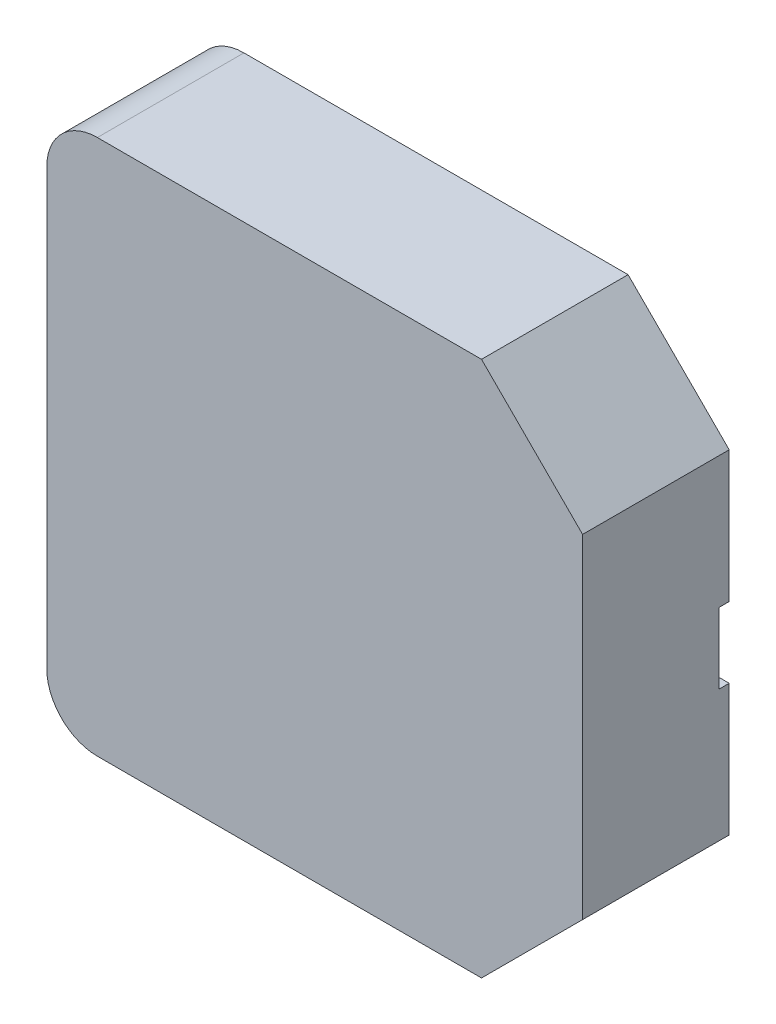
ISO-10303-21;
HEADER;
FILE_DESCRIPTION(('STEP AP214'),'2;1');
FILE_NAME('part.step','',(''),(''),'','','');
FILE_SCHEMA(('AUTOMOTIVE_DESIGN { 1 0 10303 214 1 1 1 1 }'));
ENDSEC;
DATA;
#1=APPLICATION_CONTEXT('core data for automotive mechanical design processes');
#2=APPLICATION_PROTOCOL_DEFINITION('international standard','automotive_design',2000,#1);
#3=PRODUCT_CONTEXT('',#1,'mechanical');
#4=PRODUCT('Part','Part','',(#3));
#5=PRODUCT_RELATED_PRODUCT_CATEGORY('part','',(#4));
#6=PRODUCT_DEFINITION_FORMATION('','',#4);
#7=PRODUCT_DEFINITION_CONTEXT('part definition',#1,'design');
#8=PRODUCT_DEFINITION('design','',#6,#7);
#9=PRODUCT_DEFINITION_SHAPE('','',#8);
#10=(LENGTH_UNIT() NAMED_UNIT(*) SI_UNIT(.MILLI.,.METRE.));
#11=(NAMED_UNIT(*) PLANE_ANGLE_UNIT() SI_UNIT($,.RADIAN.));
#12=(NAMED_UNIT(*) SI_UNIT($,.STERADIAN.) SOLID_ANGLE_UNIT());
#13=UNCERTAINTY_MEASURE_WITH_UNIT(LENGTH_MEASURE(1.E-05),#10,'distance_accuracy_value','');
#14=(GEOMETRIC_REPRESENTATION_CONTEXT(3) GLOBAL_UNCERTAINTY_ASSIGNED_CONTEXT((#13)) GLOBAL_UNIT_ASSIGNED_CONTEXT((#10,
#11,#12)) REPRESENTATION_CONTEXT('',''));
#15=CARTESIAN_POINT('',(0.,0.,0.));
#16=DIRECTION('',(0.,0.,1.));
#17=DIRECTION('',(1.,0.,0.));
#18=AXIS2_PLACEMENT_3D('',#15,#16,#17);
#19=CARTESIAN_POINT('',(1.05723560904739,2.65,0.1));
#20=DIRECTION('',(0.,0.,1.));
#21=DIRECTION('',(1.,0.,0.));
#22=AXIS2_PLACEMENT_3D('',#19,#20,#21);
#23=PLANE('',#22);
#24=CARTESIAN_POINT('',(1.9,2.65,0.1));
#25=DIRECTION('',(0.,0.,-1.));
#26=DIRECTION('',(-1.,0.,0.));
#27=AXIS2_PLACEMENT_3D('',#24,#25,#26);
#28=CIRCLE('',#27,0.35);
#29=CARTESIAN_POINT('',(1.9,3.,0.1));
#30=VERTEX_POINT('',#29);
#31=CARTESIAN_POINT('',(1.9,2.3,0.1));
#32=VERTEX_POINT('',#31);
#33=EDGE_CURVE('E20',#30,#32,#28,.T.);
#34=ORIENTED_EDGE('',*,*,#33,.T.);
#35=DIRECTION('',(1.,0.,0.));
#36=VECTOR('',#35,1.);
#37=CARTESIAN_POINT('',(1.9,2.3,0.1));
#38=LINE('',#37,#36);
#39=CARTESIAN_POINT('',(0.,2.3,0.1));
#40=VERTEX_POINT('',#39);
#41=EDGE_CURVE('E155',#32,#40,#38,.F.);
#42=ORIENTED_EDGE('',*,*,#41,.T.);
#43=DIRECTION('',(0.,1.,0.));
#44=VECTOR('',#43,1.);
#45=CARTESIAN_POINT('',(0.,2.65,0.1));
#46=LINE('',#45,#44);
#47=CARTESIAN_POINT('',(0.,3.,0.1));
#48=VERTEX_POINT('',#47);
#49=EDGE_CURVE('E133',#48,#40,#46,.F.);
#50=ORIENTED_EDGE('',*,*,#49,.F.);
#51=DIRECTION('',(1.,0.,0.));
#52=VECTOR('',#51,1.);
#53=CARTESIAN_POINT('',(0.,3.,0.1));
#54=LINE('',#53,#52);
#55=EDGE_CURVE('E128',#48,#30,#54,.T.);
#56=ORIENTED_EDGE('',*,*,#55,.T.);
#57=EDGE_LOOP('',(#34,#42,#50,#56));
#58=FACE_BOUND('',#57,.T.);
#59=ADVANCED_FACE('F17',(#58),#23,.F.);
#60=CARTESIAN_POINT('',(4.24276439095261,2.65,0.1));
#61=DIRECTION('',(0.,0.,1.));
#62=DIRECTION('',(1.,0.,0.));
#63=AXIS2_PLACEMENT_3D('',#60,#61,#62);
#64=PLANE('',#63);
#65=DIRECTION('',(1.,0.,0.));
#66=VECTOR('',#65,1.);
#67=CARTESIAN_POINT('',(5.3,2.3,0.1));
#68=LINE('',#67,#66);
#69=CARTESIAN_POINT('',(5.3,2.3,0.1));
#70=VERTEX_POINT('',#69);
#71=CARTESIAN_POINT('',(3.4,2.3,0.1));
#72=VERTEX_POINT('',#71);
#73=EDGE_CURVE('E175',#70,#72,#68,.F.);
#74=ORIENTED_EDGE('',*,*,#73,.T.);
#75=CARTESIAN_POINT('',(3.4,2.65,0.1));
#76=DIRECTION('',(0.,0.,-1.));
#77=DIRECTION('',(-1.,0.,0.));
#78=AXIS2_PLACEMENT_3D('',#75,#76,#77);
#79=CIRCLE('',#78,0.35);
#80=CARTESIAN_POINT('',(3.4,3.,0.1));
#81=VERTEX_POINT('',#80);
#82=EDGE_CURVE('E202',#72,#81,#79,.T.);
#83=ORIENTED_EDGE('',*,*,#82,.T.);
#84=DIRECTION('',(1.,0.,0.));
#85=VECTOR('',#84,1.);
#86=CARTESIAN_POINT('',(3.4,3.,0.1));
#87=LINE('',#86,#85);
#88=CARTESIAN_POINT('',(5.3,3.,0.1));
#89=VERTEX_POINT('',#88);
#90=EDGE_CURVE('E165',#81,#89,#87,.T.);
#91=ORIENTED_EDGE('',*,*,#90,.T.);
#92=DIRECTION('',(0.,1.,0.));
#93=VECTOR('',#92,1.);
#94=CARTESIAN_POINT('',(5.3,2.65,0.1));
#95=LINE('',#94,#93);
#96=EDGE_CURVE('E162',#70,#89,#95,.T.);
#97=ORIENTED_EDGE('',*,*,#96,.F.);
#98=EDGE_LOOP('',(#74,#83,#91,#97));
#99=FACE_BOUND('',#98,.T.);
#100=ADVANCED_FACE('F225',(#99),#64,.F.);
#101=CARTESIAN_POINT('',(0.,3.,0.));
#102=DIRECTION('',(0.,1.,0.));
#103=DIRECTION('',(0.,0.,1.));
#104=AXIS2_PLACEMENT_3D('',#101,#102,#103);
#105=PLANE('',#104);
#106=DIRECTION('',(0.,0.,1.));
#107=VECTOR('',#106,1.);
#108=CARTESIAN_POINT('',(0.,3.,0.));
#109=LINE('',#108,#107);
#110=CARTESIAN_POINT('',(0.,3.,0.));
#111=VERTEX_POINT('',#110);
#112=EDGE_CURVE('E136',#111,#48,#109,.T.);
#113=ORIENTED_EDGE('',*,*,#112,.F.);
#114=DIRECTION('',(1.,0.,0.));
#115=VECTOR('',#114,1.);
#116=CARTESIAN_POINT('',(2.65,3.,0.));
#117=LINE('',#116,#115);
#118=CARTESIAN_POINT('',(1.9,3.,0.));
#119=VERTEX_POINT('',#118);
#120=EDGE_CURVE('E141',#111,#119,#117,.T.);
#121=ORIENTED_EDGE('',*,*,#120,.T.);
#122=DIRECTION('',(0.,0.,-1.));
#123=VECTOR('',#122,1.);
#124=CARTESIAN_POINT('',(1.9,3.,0.));
#125=LINE('',#124,#123);
#126=EDGE_CURVE('E135',#119,#30,#125,.F.);
#127=ORIENTED_EDGE('',*,*,#126,.T.);
#128=ORIENTED_EDGE('',*,*,#55,.F.);
#129=EDGE_LOOP('',(#113,#121,#127,#128));
#130=FACE_BOUND('',#129,.T.);
#131=ADVANCED_FACE('F139',(#130),#105,.F.);
#132=CARTESIAN_POINT('',(1.9,2.65,0.));
#133=DIRECTION('',(0.,0.,-1.));
#134=DIRECTION('',(-1.,0.,0.));
#135=AXIS2_PLACEMENT_3D('',#132,#133,#134);
#136=CYLINDRICAL_SURFACE('',#135,0.35);
#137=ORIENTED_EDGE('',*,*,#126,.F.);
#138=CARTESIAN_POINT('',(1.9,2.65,0.));
#139=DIRECTION('',(0.,0.,-1.));
#140=DIRECTION('',(-1.,0.,0.));
#141=AXIS2_PLACEMENT_3D('',#138,#139,#140);
#142=CIRCLE('',#141,0.35);
#143=CARTESIAN_POINT('',(1.9,2.3,0.));
#144=VERTEX_POINT('',#143);
#145=EDGE_CURVE('E196',#119,#144,#142,.T.);
#146=ORIENTED_EDGE('',*,*,#145,.T.);
#147=DIRECTION('',(0.,0.,-1.));
#148=VECTOR('',#147,1.);
#149=CARTESIAN_POINT('',(1.9,2.3,0.));
#150=LINE('',#149,#148);
#151=EDGE_CURVE('E147',#144,#32,#150,.F.);
#152=ORIENTED_EDGE('',*,*,#151,.T.);
#153=ORIENTED_EDGE('',*,*,#33,.F.);
#154=EDGE_LOOP('',(#137,#146,#152,#153));
#155=FACE_BOUND('',#154,.T.);
#156=ADVANCED_FACE('F145',(#155),#136,.F.);
#157=CARTESIAN_POINT('',(1.9,2.3,0.));
#158=DIRECTION('',(0.,-1.,0.));
#159=DIRECTION('',(0.,0.,-1.));
#160=AXIS2_PLACEMENT_3D('',#157,#158,#159);
#161=PLANE('',#160);
#162=ORIENTED_EDGE('',*,*,#151,.F.);
#163=DIRECTION('',(1.,0.,0.));
#164=VECTOR('',#163,1.);
#165=CARTESIAN_POINT('',(2.65,2.3,0.));
#166=LINE('',#165,#164);
#167=CARTESIAN_POINT('',(0.,2.3,0.));
#168=VERTEX_POINT('',#167);
#169=EDGE_CURVE('E195',#144,#168,#166,.F.);
#170=ORIENTED_EDGE('',*,*,#169,.T.);
#171=DIRECTION('',(0.,0.,-1.));
#172=VECTOR('',#171,1.);
#173=CARTESIAN_POINT('',(0.,2.3,0.));
#174=LINE('',#173,#172);
#175=EDGE_CURVE('E149',#40,#168,#174,.T.);
#176=ORIENTED_EDGE('',*,*,#175,.F.);
#177=ORIENTED_EDGE('',*,*,#41,.F.);
#178=EDGE_LOOP('',(#162,#170,#176,#177));
#179=FACE_BOUND('',#178,.T.);
#180=ADVANCED_FACE('F231',(#179),#161,.F.);
#181=CARTESIAN_POINT('',(5.3,2.3,0.));
#182=DIRECTION('',(0.,-1.,0.));
#183=DIRECTION('',(0.,0.,-1.));
#184=AXIS2_PLACEMENT_3D('',#181,#182,#183);
#185=PLANE('',#184);
#186=DIRECTION('',(0.,0.,-1.));
#187=VECTOR('',#186,1.);
#188=CARTESIAN_POINT('',(5.3,2.3,0.));
#189=LINE('',#188,#187);
#190=CARTESIAN_POINT('',(5.3,2.3,0.));
#191=VERTEX_POINT('',#190);
#192=EDGE_CURVE('E178',#191,#70,#189,.F.);
#193=ORIENTED_EDGE('',*,*,#192,.F.);
#194=DIRECTION('',(1.,0.,0.));
#195=VECTOR('',#194,1.);
#196=CARTESIAN_POINT('',(2.65,2.3,0.));
#197=LINE('',#196,#195);
#198=CARTESIAN_POINT('',(3.4,2.3,0.));
#199=VERTEX_POINT('',#198);
#200=EDGE_CURVE('E192',#191,#199,#197,.F.);
#201=ORIENTED_EDGE('',*,*,#200,.T.);
#202=DIRECTION('',(0.,0.,-1.));
#203=VECTOR('',#202,1.);
#204=CARTESIAN_POINT('',(3.4,2.3,0.));
#205=LINE('',#204,#203);
#206=EDGE_CURVE('E177',#199,#72,#205,.F.);
#207=ORIENTED_EDGE('',*,*,#206,.T.);
#208=ORIENTED_EDGE('',*,*,#73,.F.);
#209=EDGE_LOOP('',(#193,#201,#207,#208));
#210=FACE_BOUND('',#209,.T.);
#211=ADVANCED_FACE('F228',(#210),#185,.F.);
#212=CARTESIAN_POINT('',(3.4,2.65,0.));
#213=DIRECTION('',(0.,0.,-1.));
#214=DIRECTION('',(-1.,0.,0.));
#215=AXIS2_PLACEMENT_3D('',#212,#213,#214);
#216=CYLINDRICAL_SURFACE('',#215,0.35);
#217=ORIENTED_EDGE('',*,*,#206,.F.);
#218=CARTESIAN_POINT('',(3.4,2.65,0.));
#219=DIRECTION('',(0.,0.,-1.));
#220=DIRECTION('',(-1.,0.,0.));
#221=AXIS2_PLACEMENT_3D('',#218,#219,#220);
#222=CIRCLE('',#221,0.35);
#223=CARTESIAN_POINT('',(3.4,3.,0.));
#224=VERTEX_POINT('',#223);
#225=EDGE_CURVE('E189',#199,#224,#222,.T.);
#226=ORIENTED_EDGE('',*,*,#225,.T.);
#227=DIRECTION('',(0.,0.,1.));
#228=VECTOR('',#227,1.);
#229=CARTESIAN_POINT('',(3.4,3.,0.));
#230=LINE('',#229,#228);
#231=EDGE_CURVE('E169',#224,#81,#230,.T.);
#232=ORIENTED_EDGE('',*,*,#231,.T.);
#233=ORIENTED_EDGE('',*,*,#82,.F.);
#234=EDGE_LOOP('',(#217,#226,#232,#233));
#235=FACE_BOUND('',#234,.T.);
#236=ADVANCED_FACE('F230',(#235),#216,.F.);
#237=CARTESIAN_POINT('',(3.4,3.,0.));
#238=DIRECTION('',(0.,1.,0.));
#239=DIRECTION('',(0.,0.,1.));
#240=AXIS2_PLACEMENT_3D('',#237,#238,#239);
#241=PLANE('',#240);
#242=ORIENTED_EDGE('',*,*,#231,.F.);
#243=DIRECTION('',(1.,0.,0.));
#244=VECTOR('',#243,1.);
#245=CARTESIAN_POINT('',(2.65,3.,0.));
#246=LINE('',#245,#244);
#247=CARTESIAN_POINT('',(5.3,3.,0.));
#248=VERTEX_POINT('',#247);
#249=EDGE_CURVE('E191',#224,#248,#246,.T.);
#250=ORIENTED_EDGE('',*,*,#249,.T.);
#251=DIRECTION('',(0.,0.,1.));
#252=VECTOR('',#251,1.);
#253=CARTESIAN_POINT('',(5.3,3.,0.));
#254=LINE('',#253,#252);
#255=EDGE_CURVE('E203',#89,#248,#254,.F.);
#256=ORIENTED_EDGE('',*,*,#255,.F.);
#257=ORIENTED_EDGE('',*,*,#90,.F.);
#258=EDGE_LOOP('',(#242,#250,#256,#257));
#259=FACE_BOUND('',#258,.T.);
#260=ADVANCED_FACE('F238',(#259),#241,.F.);
#261=CARTESIAN_POINT('',(0.5,0.5,0.));
#262=DIRECTION('',(0.,0.,-1.));
#263=DIRECTION('',(-1.,0.,0.));
#264=AXIS2_PLACEMENT_3D('',#261,#262,#263);
#265=CYLINDRICAL_SURFACE('',#264,0.5);
#266=CARTESIAN_POINT('',(0.5,0.5,0.));
#267=DIRECTION('',(0.,0.,-1.));
#268=DIRECTION('',(-1.,0.,0.));
#269=AXIS2_PLACEMENT_3D('',#266,#267,#268);
#270=CIRCLE('',#269,0.5);
#271=CARTESIAN_POINT('',(0.,0.5,0.));
#272=VERTEX_POINT('',#271);
#273=CARTESIAN_POINT('',(0.5,0.,0.));
#274=VERTEX_POINT('',#273);
#275=EDGE_CURVE('E193',#272,#274,#270,.F.);
#276=ORIENTED_EDGE('',*,*,#275,.T.);
#277=DIRECTION('',(0.,0.,-1.));
#278=VECTOR('',#277,1.);
#279=CARTESIAN_POINT('',(0.5,0.,0.));
#280=LINE('',#279,#278);
#281=CARTESIAN_POINT('',(0.5,0.,1.45));
#282=VERTEX_POINT('',#281);
#283=EDGE_CURVE('E339',#282,#274,#280,.T.);
#284=ORIENTED_EDGE('',*,*,#283,.F.);
#285=CARTESIAN_POINT('',(0.5,0.5,1.45));
#286=DIRECTION('',(0.,0.,-1.));
#287=DIRECTION('',(-1.,0.,0.));
#288=AXIS2_PLACEMENT_3D('',#285,#286,#287);
#289=CIRCLE('',#288,0.5);
#290=CARTESIAN_POINT('',(0.,0.5,1.45));
#291=VERTEX_POINT('',#290);
#292=EDGE_CURVE('E168',#282,#291,#289,.T.);
#293=ORIENTED_EDGE('',*,*,#292,.T.);
#294=DIRECTION('',(0.,0.,1.));
#295=VECTOR('',#294,1.);
#296=CARTESIAN_POINT('',(0.,0.5,0.));
#297=LINE('',#296,#295);
#298=EDGE_CURVE('E297',#272,#291,#297,.T.);
#299=ORIENTED_EDGE('',*,*,#298,.F.);
#300=EDGE_LOOP('',(#276,#284,#293,#299));
#301=FACE_BOUND('',#300,.T.);
#302=ADVANCED_FACE('F278',(#301),#265,.T.);
#303=CARTESIAN_POINT('',(0.5,4.8,0.));
#304=DIRECTION('',(0.,0.,-1.));
#305=DIRECTION('',(-1.,0.,0.));
#306=AXIS2_PLACEMENT_3D('',#303,#304,#305);
#307=CYLINDRICAL_SURFACE('',#306,0.5);
#308=CARTESIAN_POINT('',(0.5,4.8,0.));
#309=DIRECTION('',(0.,0.,-1.));
#310=DIRECTION('',(-1.,0.,0.));
#311=AXIS2_PLACEMENT_3D('',#308,#309,#310);
#312=CIRCLE('',#311,0.5);
#313=CARTESIAN_POINT('',(0.5,5.3,0.));
#314=VERTEX_POINT('',#313);
#315=CARTESIAN_POINT('',(0.,4.8,0.));
#316=VERTEX_POINT('',#315);
#317=EDGE_CURVE('E198',#314,#316,#312,.F.);
#318=ORIENTED_EDGE('',*,*,#317,.T.);
#319=DIRECTION('',(0.,0.,1.));
#320=VECTOR('',#319,1.);
#321=CARTESIAN_POINT('',(0.,4.8,0.));
#322=LINE('',#321,#320);
#323=CARTESIAN_POINT('',(0.,4.8,1.45));
#324=VERTEX_POINT('',#323);
#325=EDGE_CURVE('E345',#324,#316,#322,.F.);
#326=ORIENTED_EDGE('',*,*,#325,.F.);
#327=CARTESIAN_POINT('',(0.5,4.8,1.45));
#328=DIRECTION('',(0.,0.,-1.));
#329=DIRECTION('',(-1.,0.,0.));
#330=AXIS2_PLACEMENT_3D('',#327,#328,#329);
#331=CIRCLE('',#330,0.5);
#332=CARTESIAN_POINT('',(0.5,5.3,1.45));
#333=VERTEX_POINT('',#332);
#334=EDGE_CURVE('E200',#324,#333,#331,.T.);
#335=ORIENTED_EDGE('',*,*,#334,.T.);
#336=DIRECTION('',(0.,0.,1.));
#337=VECTOR('',#336,1.);
#338=CARTESIAN_POINT('',(0.5,5.3,0.));
#339=LINE('',#338,#337);
#340=EDGE_CURVE('E321',#314,#333,#339,.T.);
#341=ORIENTED_EDGE('',*,*,#340,.F.);
#342=EDGE_LOOP('',(#318,#326,#335,#341));
#343=FACE_BOUND('',#342,.T.);
#344=ADVANCED_FACE('F274',(#343),#307,.T.);
#345=CARTESIAN_POINT('',(2.65,2.65,0.));
#346=DIRECTION('',(0.,0.,1.));
#347=DIRECTION('',(1.,0.,0.));
#348=AXIS2_PLACEMENT_3D('',#345,#346,#347);
#349=PLANE('',#348);
#350=ORIENTED_EDGE('',*,*,#225,.F.);
#351=ORIENTED_EDGE('',*,*,#200,.F.);
#352=DIRECTION('',(0.,1.,0.));
#353=VECTOR('',#352,1.);
#354=CARTESIAN_POINT('',(5.3,5.3,0.));
#355=LINE('',#354,#353);
#356=CARTESIAN_POINT('',(5.3,1.,0.));
#357=VERTEX_POINT('',#356);
#358=EDGE_CURVE('E223',#357,#191,#355,.T.);
#359=ORIENTED_EDGE('',*,*,#358,.F.);
#360=DIRECTION('',(0.707106781186548,0.707106781186548,0.));
#361=VECTOR('',#360,1.);
#362=CARTESIAN_POINT('',(4.8,0.5,0.));
#363=LINE('',#362,#361);
#364=CARTESIAN_POINT('',(4.3,0.,0.));
#365=VERTEX_POINT('',#364);
#366=EDGE_CURVE('E327',#365,#357,#363,.T.);
#367=ORIENTED_EDGE('',*,*,#366,.F.);
#368=DIRECTION('',(1.,0.,0.));
#369=VECTOR('',#368,1.);
#370=CARTESIAN_POINT('',(5.3,0.,0.));
#371=LINE('',#370,#369);
#372=EDGE_CURVE('E337',#274,#365,#371,.T.);
#373=ORIENTED_EDGE('',*,*,#372,.F.);
#374=ORIENTED_EDGE('',*,*,#275,.F.);
#375=DIRECTION('',(0.,1.,0.));
#376=VECTOR('',#375,1.);
#377=CARTESIAN_POINT('',(0.,0.,0.));
#378=LINE('',#377,#376);
#379=EDGE_CURVE('E295',#168,#272,#378,.F.);
#380=ORIENTED_EDGE('',*,*,#379,.F.);
#381=ORIENTED_EDGE('',*,*,#169,.F.);
#382=ORIENTED_EDGE('',*,*,#145,.F.);
#383=ORIENTED_EDGE('',*,*,#120,.F.);
#384=DIRECTION('',(0.,1.,0.));
#385=VECTOR('',#384,1.);
#386=CARTESIAN_POINT('',(0.,0.,0.));
#387=LINE('',#386,#385);
#388=EDGE_CURVE('E342',#316,#111,#387,.F.);
#389=ORIENTED_EDGE('',*,*,#388,.F.);
#390=ORIENTED_EDGE('',*,*,#317,.F.);
#391=DIRECTION('',(1.,0.,0.));
#392=VECTOR('',#391,1.);
#393=CARTESIAN_POINT('',(0.,5.3,0.));
#394=LINE('',#393,#392);
#395=CARTESIAN_POINT('',(4.3,5.3,0.));
#396=VERTEX_POINT('',#395);
#397=EDGE_CURVE('E313',#396,#314,#394,.F.);
#398=ORIENTED_EDGE('',*,*,#397,.F.);
#399=DIRECTION('',(-0.707106781186548,0.707106781186548,0.));
#400=VECTOR('',#399,1.);
#401=CARTESIAN_POINT('',(4.8,4.8,0.));
#402=LINE('',#401,#400);
#403=CARTESIAN_POINT('',(5.3,4.3,0.));
#404=VERTEX_POINT('',#403);
#405=EDGE_CURVE('E319',#404,#396,#402,.T.);
#406=ORIENTED_EDGE('',*,*,#405,.F.);
#407=DIRECTION('',(0.,1.,0.));
#408=VECTOR('',#407,1.);
#409=CARTESIAN_POINT('',(5.3,5.3,0.));
#410=LINE('',#409,#408);
#411=EDGE_CURVE('E294',#248,#404,#410,.T.);
#412=ORIENTED_EDGE('',*,*,#411,.F.);
#413=ORIENTED_EDGE('',*,*,#249,.F.);
#414=EDGE_LOOP('',(#350,#351,#359,#367,#373,#374,#380,#381,#382,#383,#389,#390,#398,#406,#412,#413));
#415=FACE_BOUND('',#414,.T.);
#416=ADVANCED_FACE('F271',(#415),#349,.F.);
#417=CARTESIAN_POINT('',(0.,0.,0.));
#418=DIRECTION('',(-1.,0.,0.));
#419=DIRECTION('',(0.,0.,1.));
#420=AXIS2_PLACEMENT_3D('',#417,#418,#419);
#421=PLANE('',#420);
#422=ORIENTED_EDGE('',*,*,#325,.T.);
#423=ORIENTED_EDGE('',*,*,#388,.T.);
#424=ORIENTED_EDGE('',*,*,#112,.T.);
#425=ORIENTED_EDGE('',*,*,#49,.T.);
#426=ORIENTED_EDGE('',*,*,#175,.T.);
#427=ORIENTED_EDGE('',*,*,#379,.T.);
#428=ORIENTED_EDGE('',*,*,#298,.T.);
#429=DIRECTION('',(0.,1.,0.));
#430=VECTOR('',#429,1.);
#431=CARTESIAN_POINT('',(0.,2.65,1.45));
#432=LINE('',#431,#430);
#433=EDGE_CURVE('E316',#324,#291,#432,.F.);
#434=ORIENTED_EDGE('',*,*,#433,.F.);
#435=EDGE_LOOP('',(#422,#423,#424,#425,#426,#427,#428,#434));
#436=FACE_BOUND('',#435,.T.);
#437=ADVANCED_FACE('F267',(#436),#421,.T.);
#438=CARTESIAN_POINT('',(5.3,0.,0.));
#439=DIRECTION('',(0.,-1.,0.));
#440=DIRECTION('',(0.,0.,-1.));
#441=AXIS2_PLACEMENT_3D('',#438,#439,#440);
#442=PLANE('',#441);
#443=DIRECTION('',(0.,0.,1.));
#444=VECTOR('',#443,1.);
#445=CARTESIAN_POINT('',(4.3,0.,0.));
#446=LINE('',#445,#444);
#447=CARTESIAN_POINT('',(4.3,0.,1.45));
#448=VERTEX_POINT('',#447);
#449=EDGE_CURVE('E331',#448,#365,#446,.F.);
#450=ORIENTED_EDGE('',*,*,#449,.F.);
#451=DIRECTION('',(1.,0.,0.));
#452=VECTOR('',#451,1.);
#453=CARTESIAN_POINT('',(2.65,0.,1.45));
#454=LINE('',#453,#452);
#455=EDGE_CURVE('E367',#282,#448,#454,.T.);
#456=ORIENTED_EDGE('',*,*,#455,.F.);
#457=ORIENTED_EDGE('',*,*,#283,.T.);
#458=ORIENTED_EDGE('',*,*,#372,.T.);
#459=EDGE_LOOP('',(#450,#456,#457,#458));
#460=FACE_BOUND('',#459,.T.);
#461=ADVANCED_FACE('F263',(#460),#442,.T.);
#462=CARTESIAN_POINT('',(4.8,0.5,0.));
#463=DIRECTION('',(0.707106781186548,-0.707106781186548,0.));
#464=DIRECTION('',(0.707106781186548,0.707106781186548,0.));
#465=AXIS2_PLACEMENT_3D('',#462,#463,#464);
#466=PLANE('',#465);
#467=ORIENTED_EDGE('',*,*,#366,.T.);
#468=DIRECTION('',(0.,0.,-1.));
#469=VECTOR('',#468,1.);
#470=CARTESIAN_POINT('',(5.3,1.,0.));
#471=LINE('',#470,#469);
#472=CARTESIAN_POINT('',(5.3,1.,1.45));
#473=VERTEX_POINT('',#472);
#474=EDGE_CURVE('E326',#473,#357,#471,.T.);
#475=ORIENTED_EDGE('',*,*,#474,.F.);
#476=DIRECTION('',(0.707106781186548,0.707106781186548,0.));
#477=VECTOR('',#476,1.);
#478=CARTESIAN_POINT('',(4.3,0.,1.45));
#479=LINE('',#478,#477);
#480=EDGE_CURVE('E363',#448,#473,#479,.T.);
#481=ORIENTED_EDGE('',*,*,#480,.F.);
#482=ORIENTED_EDGE('',*,*,#449,.T.);
#483=EDGE_LOOP('',(#467,#475,#481,#482));
#484=FACE_BOUND('',#483,.T.);
#485=ADVANCED_FACE('F260',(#484),#466,.T.);
#486=CARTESIAN_POINT('',(5.3,5.3,0.));
#487=DIRECTION('',(1.,0.,0.));
#488=DIRECTION('',(0.,0.,-1.));
#489=AXIS2_PLACEMENT_3D('',#486,#487,#488);
#490=PLANE('',#489);
#491=ORIENTED_EDGE('',*,*,#192,.T.);
#492=ORIENTED_EDGE('',*,*,#96,.T.);
#493=ORIENTED_EDGE('',*,*,#255,.T.);
#494=ORIENTED_EDGE('',*,*,#411,.T.);
#495=DIRECTION('',(0.,0.,1.));
#496=VECTOR('',#495,1.);
#497=CARTESIAN_POINT('',(5.3,4.3,0.));
#498=LINE('',#497,#496);
#499=CARTESIAN_POINT('',(5.3,4.3,1.45));
#500=VERTEX_POINT('',#499);
#501=EDGE_CURVE('E322',#500,#404,#498,.F.);
#502=ORIENTED_EDGE('',*,*,#501,.F.);
#503=DIRECTION('',(0.,1.,0.));
#504=VECTOR('',#503,1.);
#505=CARTESIAN_POINT('',(5.3,2.65,1.45));
#506=LINE('',#505,#504);
#507=EDGE_CURVE('E366',#473,#500,#506,.T.);
#508=ORIENTED_EDGE('',*,*,#507,.F.);
#509=ORIENTED_EDGE('',*,*,#474,.T.);
#510=ORIENTED_EDGE('',*,*,#358,.T.);
#511=EDGE_LOOP('',(#491,#492,#493,#494,#502,#508,#509,#510));
#512=FACE_BOUND('',#511,.T.);
#513=ADVANCED_FACE('F220',(#512),#490,.T.);
#514=CARTESIAN_POINT('',(4.8,4.8,0.));
#515=DIRECTION('',(0.707106781186548,0.707106781186548,0.));
#516=DIRECTION('',(-0.707106781186548,0.707106781186548,0.));
#517=AXIS2_PLACEMENT_3D('',#514,#515,#516);
#518=PLANE('',#517);
#519=ORIENTED_EDGE('',*,*,#405,.T.);
#520=DIRECTION('',(0.,0.,1.));
#521=VECTOR('',#520,1.);
#522=CARTESIAN_POINT('',(4.3,5.3,0.));
#523=LINE('',#522,#521);
#524=CARTESIAN_POINT('',(4.3,5.3,1.45));
#525=VERTEX_POINT('',#524);
#526=EDGE_CURVE('E35',#525,#396,#523,.F.);
#527=ORIENTED_EDGE('',*,*,#526,.F.);
#528=DIRECTION('',(-0.707106781186548,0.707106781186548,0.));
#529=VECTOR('',#528,1.);
#530=CARTESIAN_POINT('',(5.3,4.3,1.45));
#531=LINE('',#530,#529);
#532=EDGE_CURVE('E26',#500,#525,#531,.T.);
#533=ORIENTED_EDGE('',*,*,#532,.F.);
#534=ORIENTED_EDGE('',*,*,#501,.T.);
#535=EDGE_LOOP('',(#519,#527,#533,#534));
#536=FACE_BOUND('',#535,.T.);
#537=ADVANCED_FACE('F251',(#536),#518,.T.);
#538=CARTESIAN_POINT('',(0.,5.3,0.));
#539=DIRECTION('',(0.,1.,0.));
#540=DIRECTION('',(0.,0.,1.));
#541=AXIS2_PLACEMENT_3D('',#538,#539,#540);
#542=PLANE('',#541);
#543=ORIENTED_EDGE('',*,*,#526,.T.);
#544=ORIENTED_EDGE('',*,*,#397,.T.);
#545=ORIENTED_EDGE('',*,*,#340,.T.);
#546=DIRECTION('',(1.,0.,0.));
#547=VECTOR('',#546,1.);
#548=CARTESIAN_POINT('',(2.65,5.3,1.45));
#549=LINE('',#548,#547);
#550=EDGE_CURVE('E11',#525,#333,#549,.F.);
#551=ORIENTED_EDGE('',*,*,#550,.F.);
#552=EDGE_LOOP('',(#543,#544,#545,#551));
#553=FACE_BOUND('',#552,.T.);
#554=ADVANCED_FACE('F245',(#553),#542,.T.);
#555=CARTESIAN_POINT('',(2.65,2.65,1.45));
#556=DIRECTION('',(0.,0.,1.));
#557=DIRECTION('',(1.,0.,0.));
#558=AXIS2_PLACEMENT_3D('',#555,#556,#557);
#559=PLANE('',#558);
#560=ORIENTED_EDGE('',*,*,#532,.T.);
#561=ORIENTED_EDGE('',*,*,#550,.T.);
#562=ORIENTED_EDGE('',*,*,#334,.F.);
#563=ORIENTED_EDGE('',*,*,#433,.T.);
#564=ORIENTED_EDGE('',*,*,#292,.F.);
#565=ORIENTED_EDGE('',*,*,#455,.T.);
#566=ORIENTED_EDGE('',*,*,#480,.T.);
#567=ORIENTED_EDGE('',*,*,#507,.T.);
#568=EDGE_LOOP('',(#560,#561,#562,#563,#564,#565,#566,#567));
#569=FACE_BOUND('',#568,.T.);
#570=ADVANCED_FACE('F243',(#569),#559,.T.);
#571=CLOSED_SHELL('',(#59,#100,#131,#156,#180,#211,#236,#260,#302,#344,#416,#437,#461,#485,#513,
#537,#554,#570));
#572=MANIFOLD_SOLID_BREP('B1',#571);
#573=ADVANCED_BREP_SHAPE_REPRESENTATION('',(#18,#572),#14);
#574=SHAPE_DEFINITION_REPRESENTATION(#9,#573);
ENDSEC;
END-ISO-10303-21;
